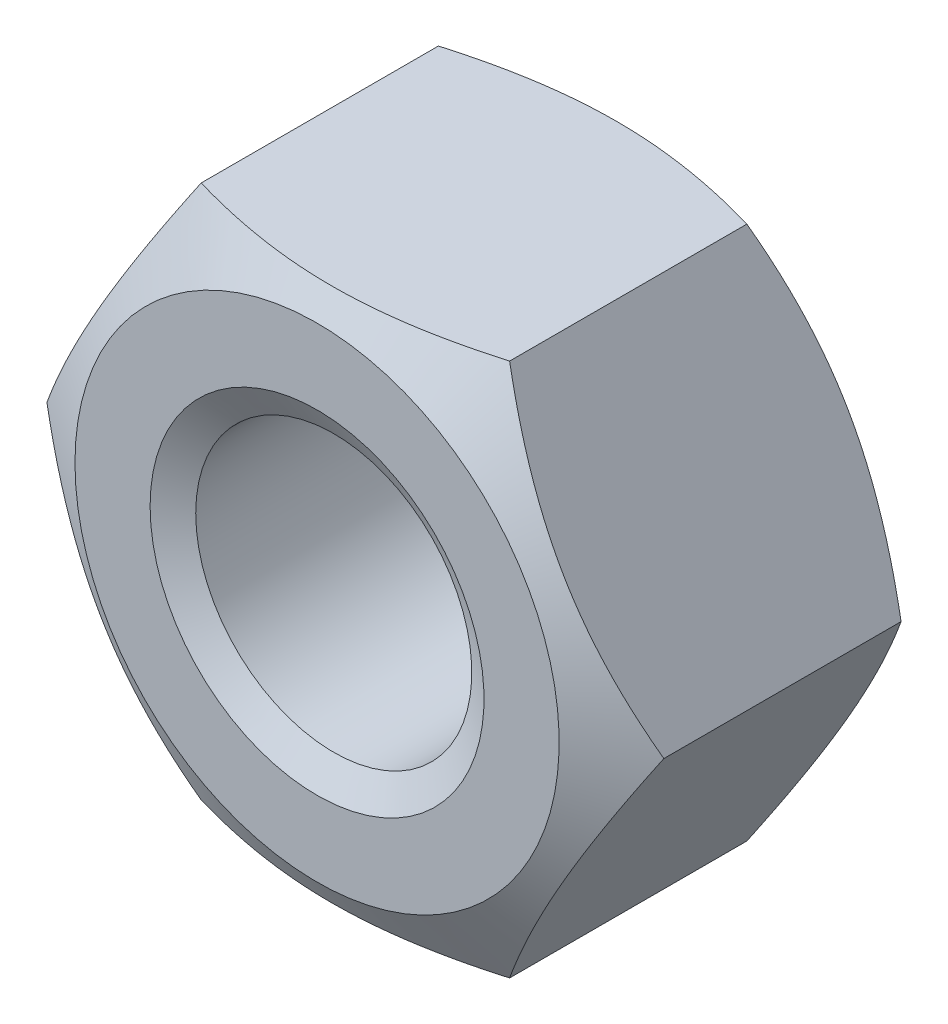
ISO-10303-21;
HEADER;
FILE_DESCRIPTION(('STEP AP214'),'2;1');
FILE_NAME('part.step','',(''),(''),'','','');
FILE_SCHEMA(('AUTOMOTIVE_DESIGN { 1 0 10303 214 1 1 1 1 }'));
ENDSEC;
DATA;
#1=APPLICATION_CONTEXT('core data for automotive mechanical design processes');
#2=APPLICATION_PROTOCOL_DEFINITION('international standard','automotive_design',2000,#1);
#3=PRODUCT_CONTEXT('',#1,'mechanical');
#4=PRODUCT('Part','Part','',(#3));
#5=PRODUCT_RELATED_PRODUCT_CATEGORY('part','',(#4));
#6=PRODUCT_DEFINITION_FORMATION('','',#4);
#7=PRODUCT_DEFINITION_CONTEXT('part definition',#1,'design');
#8=PRODUCT_DEFINITION('design','',#6,#7);
#9=PRODUCT_DEFINITION_SHAPE('','',#8);
#10=(LENGTH_UNIT() NAMED_UNIT(*) SI_UNIT(.MILLI.,.METRE.));
#11=(NAMED_UNIT(*) PLANE_ANGLE_UNIT() SI_UNIT($,.RADIAN.));
#12=(NAMED_UNIT(*) SI_UNIT($,.STERADIAN.) SOLID_ANGLE_UNIT());
#13=UNCERTAINTY_MEASURE_WITH_UNIT(LENGTH_MEASURE(1.E-05),#10,'distance_accuracy_value','');
#14=(GEOMETRIC_REPRESENTATION_CONTEXT(3) GLOBAL_UNCERTAINTY_ASSIGNED_CONTEXT((#13)) GLOBAL_UNIT_ASSIGNED_CONTEXT((#10,
#11,#12)) REPRESENTATION_CONTEXT('',''));
#15=CARTESIAN_POINT('',(0.,0.,0.));
#16=DIRECTION('',(0.,0.,1.));
#17=DIRECTION('',(1.,0.,0.));
#18=AXIS2_PLACEMENT_3D('',#15,#16,#17);
#19=CARTESIAN_POINT('',(2.30940107675851,-4.,-4.7));
#20=DIRECTION('',(0.866025403784439,-0.5,0.));
#21=DIRECTION('',(0.5,0.866025403784439,0.));
#22=AXIS2_PLACEMENT_3D('',#19,#20,#21);
#23=PLANE('',#22);
#24=CARTESIAN_POINT('',(2.30928560670467,-4.0002,-0.57383861002087));
#25=CARTESIAN_POINT('',(2.41077174646171,-3.82442084967677,-0.515224224594386));
#26=CARTESIAN_POINT('',(2.513133908835,-3.64712438367362,-0.461916672408367));
#27=CARTESIAN_POINT('',(2.71963072479812,-3.28946140682429,-0.368868021692509));
#28=CARTESIAN_POINT('',(2.82376904741905,-3.10908854102985,-0.32915983997581));
#29=CARTESIAN_POINT('',(3.03075510011796,-2.75057818129721,-0.267348566226386));
#30=CARTESIAN_POINT('',(3.13357098372492,-2.57249584706486,-0.244834082468996));
#31=CARTESIAN_POINT('',(3.33968651028529,-2.21549328283349,-0.21795697409269));
#32=CARTESIAN_POINT('',(3.44298540411434,-2.0365743503559,-0.213572092373052));
#33=CARTESIAN_POINT('',(3.63600352522933,-1.70225715780327,-0.222696423886078));
#34=CARTESIAN_POINT('',(3.72575165335065,-1.54680884001293,-0.233965304934102));
#35=CARTESIAN_POINT('',(3.90466320392055,-1.23692494436494,-0.2696803417443));
#36=CARTESIAN_POINT('',(3.99382600759479,-1.08249043825587,-0.29413869665764));
#37=CARTESIAN_POINT('',(4.17310641015197,-0.771967672225422,-0.355282415865396));
#38=CARTESIAN_POINT('',(4.26320131938131,-0.615918711936898,-0.39222695460097));
#39=CARTESIAN_POINT('',(4.44204742827551,-0.306148164596161,-0.476076423494133));
#40=CARTESIAN_POINT('',(4.53080091904967,-0.152422609226222,-0.522961653158845));
#41=CARTESIAN_POINT('',(4.61891762357085,0.000199999999998455,-0.573838610020871));
#42=B_SPLINE_CURVE_WITH_KNOTS('',3,(#24,#25,#26,#27,#28,#29,#30,#31,#32,#33,#34,#35,#36,#37,#38,
#39,#40,#41),.UNSPECIFIED.,.F.,.F.,(4,2,2,2,2,2,2,2,4),(0.,0.634047835695965,1.26961969224543,
1.88946157213122,2.50854226669297,3.04757825393385,3.58711366126903,4.13861653143763,
4.68903648037743),.UNSPECIFIED.);
#43=CARTESIAN_POINT('',(2.30940107675851,-4.,-0.573771940854266));
#44=VERTEX_POINT('',#43);
#45=CARTESIAN_POINT('',(4.61880215351701,0.,-0.573771940854266));
#46=VERTEX_POINT('',#45);
#47=EDGE_CURVE('E50',#44,#46,#42,.T.);
#48=ORIENTED_EDGE('',*,*,#47,.F.);
#49=DIRECTION('',(0.,0.,1.));
#50=VECTOR('',#49,1.);
#51=CARTESIAN_POINT('',(2.30940107675851,-4.,-4.7));
#52=LINE('',#51,#50);
#53=CARTESIAN_POINT('',(2.30940107675851,-4.,-4.12622805914573));
#54=VERTEX_POINT('',#53);
#55=EDGE_CURVE('E114',#54,#44,#52,.T.);
#56=ORIENTED_EDGE('',*,*,#55,.F.);
#57=CARTESIAN_POINT('',(4.61891762357085,0.000199999999998174,-4.12616138997913));
#58=CARTESIAN_POINT('',(4.51743148381381,-0.17557915032323,-4.18477577540561));
#59=CARTESIAN_POINT('',(4.41506932144052,-0.352875616326382,-4.23808332759163));
#60=CARTESIAN_POINT('',(4.2085725054774,-0.710538593175708,-4.33113197830749));
#61=CARTESIAN_POINT('',(4.10443418285647,-0.890911458970153,-4.37084016002419));
#62=CARTESIAN_POINT('',(3.89744813015756,-1.24942181870279,-4.43265143377361));
#63=CARTESIAN_POINT('',(3.7946322465506,-1.42750415293514,-4.455165917531));
#64=CARTESIAN_POINT('',(3.58851671999023,-1.78450671716651,-4.48204302590731));
#65=CARTESIAN_POINT('',(3.48521782616117,-1.9634256496441,-4.48642790762695));
#66=CARTESIAN_POINT('',(3.29219970504619,-2.29774284219673,-4.47730357611392));
#67=CARTESIAN_POINT('',(3.20245157692487,-2.45319115998707,-4.4660346950659));
#68=CARTESIAN_POINT('',(3.02354002635497,-2.76307505563506,-4.4303196582557));
#69=CARTESIAN_POINT('',(2.93437722268073,-2.91750956174413,-4.40586130334236));
#70=CARTESIAN_POINT('',(2.75509682012354,-3.22803232777458,-4.3447175841346));
#71=CARTESIAN_POINT('',(2.6650019108942,-3.3840812880631,-4.30777304539903));
#72=CARTESIAN_POINT('',(2.48615580200001,-3.69385183540384,-4.22392357650587));
#73=CARTESIAN_POINT('',(2.39740231122585,-3.84757739077378,-4.17703834684116));
#74=CARTESIAN_POINT('',(2.30928560670467,-4.0002,-4.12616138997913));
#75=B_SPLINE_CURVE_WITH_KNOTS('',3,(#57,#58,#59,#60,#61,#62,#63,#64,#65,#66,#67,#68,#69,#70,#71,
#72,#73,#74),.UNSPECIFIED.,.F.,.F.,(4,2,2,2,2,2,2,2,4),(0.,0.634047835695965,1.26961969224543,
1.88946157213122,2.50854226669297,3.04757825393386,3.58711366126903,4.13861653143763,
4.68903648037743),.UNSPECIFIED.);
#76=CARTESIAN_POINT('',(4.61880215351701,0.,-4.12622805914573));
#77=VERTEX_POINT('',#76);
#78=EDGE_CURVE('E125',#77,#54,#75,.T.);
#79=ORIENTED_EDGE('',*,*,#78,.F.);
#80=DIRECTION('',(0.,0.,1.));
#81=VECTOR('',#80,1.);
#82=CARTESIAN_POINT('',(4.61880215351701,0.,-4.7));
#83=LINE('',#82,#81);
#84=EDGE_CURVE('E122',#77,#46,#83,.T.);
#85=ORIENTED_EDGE('',*,*,#84,.T.);
#86=EDGE_LOOP('',(#48,#56,#79,#85));
#87=FACE_BOUND('',#86,.T.);
#88=ADVANCED_FACE('F35',(#87),#23,.T.);
#89=CARTESIAN_POINT('',(-2.3094010767585,-4.,-4.7));
#90=DIRECTION('',(0.,-1.,0.));
#91=DIRECTION('',(0.,0.,-1.));
#92=AXIS2_PLACEMENT_3D('',#89,#90,#91);
#93=PLANE('',#92);
#94=CARTESIAN_POINT('',(-6.09489331698854,-4.,-2.11613226172565));
#95=CARTESIAN_POINT('',(-5.91950199157586,-4.,-2.03149845459354));
#96=CARTESIAN_POINT('',(-5.74369257215838,-4.,-1.94771521780251));
#97=CARTESIAN_POINT('',(-5.39101133395398,-4.,-1.78233664211192));
#98=CARTESIAN_POINT('',(-5.21413933441671,-4.,-1.70074168913585));
#99=CARTESIAN_POINT('',(-4.85813636500876,-4.,-1.5397900151928));
#100=CARTESIAN_POINT('',(-4.67899824046454,-4.,-1.46044906153751));
#101=CARTESIAN_POINT('',(-4.31923849988323,-4.,-1.3052185148072));
#102=CARTESIAN_POINT('',(-4.13861696282555,-4.,-1.22932873937402));
#103=CARTESIAN_POINT('',(-3.7735011480398,-4.,-1.08107583924949));
#104=CARTESIAN_POINT('',(-3.58898622005784,-4.,-1.00876328992994));
#105=CARTESIAN_POINT('',(-3.21776937752919,-4.,-0.869876931081911));
#106=CARTESIAN_POINT('',(-3.03106722115793,-4.,-0.803303763044689));
#107=CARTESIAN_POINT('',(-2.65557248328835,-4.,-0.677706911420482));
#108=CARTESIAN_POINT('',(-2.46678541613765,-4.,-0.618666911849641));
#109=CARTESIAN_POINT('',(-2.08652902254126,-4.,-0.510073166124483));
#110=CARTESIAN_POINT('',(-1.8950605731911,-4.,-0.460516392299829));
#111=CARTESIAN_POINT('',(-1.50929874076661,-4.,-0.373311085934221));
#112=CARTESIAN_POINT('',(-1.31500426032992,-4.,-0.335667315781999));
#113=CARTESIAN_POINT('',(-0.924106700196855,-4.,-0.274847986643173));
#114=CARTESIAN_POINT('',(-0.727503612751561,-4.,-0.25167247623386));
#115=CARTESIAN_POINT('',(-0.334240681056907,-4.,-0.221840557573744));
#116=CARTESIAN_POINT('',(-0.137588730976595,-4.,-0.215082720352833));
#117=CARTESIAN_POINT('',(0.255527926525665,-4.,-0.218431875319073));
#118=CARTESIAN_POINT('',(0.451992668517273,-4.,-0.228534642276789));
#119=CARTESIAN_POINT('',(0.788354694254841,-4.,-0.259560117675914));
#120=CARTESIAN_POINT('',(0.928625472737157,-4.,-0.27664196987692));
#121=CARTESIAN_POINT('',(1.20806274563188,-4.,-0.318274124275839));
#122=CARTESIAN_POINT('',(1.34722906903656,-4.,-0.34282556073515));
#123=CARTESIAN_POINT('',(1.7632975044686,-4.,-0.426460434693975));
#124=CARTESIAN_POINT('',(2.03822284110857,-4.,-0.49546767495266));
#125=CARTESIAN_POINT('',(2.44940900931328,-4.,-0.61419997952369));
#126=CARTESIAN_POINT('',(2.58782303777094,-4.,-0.656885050843219));
#127=CARTESIAN_POINT('',(2.86331367399499,-4.,-0.746448608551732));
#128=CARTESIAN_POINT('',(3.00039016121333,-4.,-0.793327469111018));
#129=CARTESIAN_POINT('',(3.27252112795078,-4.,-0.89027873080736));
#130=CARTESIAN_POINT('',(3.4075826648663,-4.,-0.940331521678568));
#131=CARTESIAN_POINT('',(3.67656082616028,-4.,-1.04329523164377));
#132=CARTESIAN_POINT('',(3.81047782797029,-4.,-1.09620516281665));
#133=CARTESIAN_POINT('',(3.94391362275132,-4.,-1.15027525964541));
#134=B_SPLINE_CURVE_WITH_KNOTS('',3,(#94,#95,#96,#97,#98,#99,#100,#101,#102,#103,#104,#105,#106,
#107,#108,#109,#110,#111,#112,#113,#114,#115,#116,#117,#118,#119,#120,#121,#122,#123,#124,#125,
#126,#127,#128,#129,#130,#131,#132,#133),.UNSPECIFIED.,.F.,.F.,(4,2,2,2,2,2,2,2,2,2,2,2,2,2,2,2,
2,2,2,4),(0.,0.584238260269169,1.16857888752959,1.7563161578612,2.34402233634429,
2.93848518113533,3.53301438319361,4.12623321773499,4.71926234060197,5.31252823650208,
5.90579612428622,6.4953893548323,7.08483485682726,7.5085487103983,7.93232693734391,
8.78152355201763,9.21602908260414,9.65057341855461,10.0826543795838,10.5145868837227),.UNSPECIFIED.);
#135=CARTESIAN_POINT('',(-2.3094010767585,-4.,-0.573771940854266));
#136=VERTEX_POINT('',#135);
#137=EDGE_CURVE('E107',#136,#44,#134,.T.);
#138=ORIENTED_EDGE('',*,*,#137,.F.);
#139=DIRECTION('',(0.,0.,1.));
#140=VECTOR('',#139,1.);
#141=CARTESIAN_POINT('',(-2.3094010767585,-4.,-4.7));
#142=LINE('',#141,#140);
#143=CARTESIAN_POINT('',(-2.3094010767585,-4.,-4.12622805914573));
#144=VERTEX_POINT('',#143);
#145=EDGE_CURVE('E106',#144,#136,#142,.T.);
#146=ORIENTED_EDGE('',*,*,#145,.F.);
#147=CARTESIAN_POINT('',(-6.09489331698854,-4.,-2.58386773827435));
#148=CARTESIAN_POINT('',(-5.91950199157586,-4.,-2.66850154540646));
#149=CARTESIAN_POINT('',(-5.74369257215838,-4.,-2.75228478219749));
#150=CARTESIAN_POINT('',(-5.39101133395398,-4.,-2.91766335788808));
#151=CARTESIAN_POINT('',(-5.2141393344167,-4.,-2.99925831086415));
#152=CARTESIAN_POINT('',(-4.85813636500875,-4.,-3.1602099848072));
#153=CARTESIAN_POINT('',(-4.67899824046453,-4.,-3.23955093846249));
#154=CARTESIAN_POINT('',(-4.31923849988323,-4.,-3.3947814851928));
#155=CARTESIAN_POINT('',(-4.13861696282554,-4.,-3.47067126062598));
#156=CARTESIAN_POINT('',(-3.7735011480398,-4.,-3.61892416075051));
#157=CARTESIAN_POINT('',(-3.58898622005784,-4.,-3.69123671007006));
#158=CARTESIAN_POINT('',(-3.21776937752918,-4.,-3.83012306891809));
#159=CARTESIAN_POINT('',(-3.03106722115793,-4.,-3.89669623695531));
#160=CARTESIAN_POINT('',(-2.65557248328834,-4.,-4.02229308857952));
#161=CARTESIAN_POINT('',(-2.46678541613765,-4.,-4.08133308815036));
#162=CARTESIAN_POINT('',(-2.08652902254125,-4.,-4.18992683387552));
#163=CARTESIAN_POINT('',(-1.8950605731911,-4.,-4.23948360770017));
#164=CARTESIAN_POINT('',(-1.50929874076661,-4.,-4.32668891406578));
#165=CARTESIAN_POINT('',(-1.31500426032993,-4.,-4.364332684218));
#166=CARTESIAN_POINT('',(-0.924106700196855,-4.,-4.42515201335683));
#167=CARTESIAN_POINT('',(-0.727503612751561,-4.,-4.44832752376614));
#168=CARTESIAN_POINT('',(-0.334240681056908,-4.,-4.47815944242626));
#169=CARTESIAN_POINT('',(-0.137588730976595,-4.,-4.48491727964717));
#170=CARTESIAN_POINT('',(0.255527926525665,-4.,-4.48156812468093));
#171=CARTESIAN_POINT('',(0.451992668517273,-4.,-4.47146535772321));
#172=CARTESIAN_POINT('',(0.788354694254841,-4.,-4.44043988232409));
#173=CARTESIAN_POINT('',(0.928625472737157,-4.,-4.42335803012308));
#174=CARTESIAN_POINT('',(1.20806274563188,-4.,-4.38172587572416));
#175=CARTESIAN_POINT('',(1.34722906903656,-4.,-4.35717443926485));
#176=CARTESIAN_POINT('',(1.7632975044686,-4.,-4.27353956530602));
#177=CARTESIAN_POINT('',(2.03822284110857,-4.,-4.20453232504734));
#178=CARTESIAN_POINT('',(2.44940900931328,-4.,-4.08580002047631));
#179=CARTESIAN_POINT('',(2.58782303777094,-4.,-4.04311494915678));
#180=CARTESIAN_POINT('',(2.86331367399499,-4.,-3.95355139144827));
#181=CARTESIAN_POINT('',(3.00039016121333,-4.,-3.90667253088898));
#182=CARTESIAN_POINT('',(3.27252112795078,-4.,-3.80972126919264));
#183=CARTESIAN_POINT('',(3.4075826648663,-4.,-3.75966847832143));
#184=CARTESIAN_POINT('',(3.67656082616028,-4.,-3.65670476835623));
#185=CARTESIAN_POINT('',(3.81047782797029,-4.,-3.60379483718335));
#186=CARTESIAN_POINT('',(3.94391362275132,-4.,-3.54972474035459));
#187=B_SPLINE_CURVE_WITH_KNOTS('',3,(#147,#148,#149,#150,#151,#152,#153,#154,#155,#156,#157,
#158,#159,#160,#161,#162,#163,#164,#165,#166,#167,#168,#169,#170,#171,#172,#173,#174,#175,#176,
#177,#178,#179,#180,#181,#182,#183,#184,#185,#186),.UNSPECIFIED.,.F.,.F.,(4,2,2,2,2,2,2,2,2,2,2,
2,2,2,2,2,2,2,2,4),(0.,0.58423826026917,1.1685788875296,1.7563161578612,2.34402233634429,
2.93848518113534,3.53301438319361,4.12623321773499,4.71926234060197,5.31252823650208,
5.90579612428622,6.4953893548323,7.08483485682726,7.5085487103983,7.93232693734391,
8.78152355201763,9.21602908260414,9.65057341855461,10.0826543795838,10.5145868837227),.UNSPECIFIED.);
#188=EDGE_CURVE('E196',#54,#144,#187,.F.);
#189=ORIENTED_EDGE('',*,*,#188,.F.);
#190=ORIENTED_EDGE('',*,*,#55,.T.);
#191=EDGE_LOOP('',(#138,#146,#189,#190));
#192=FACE_BOUND('',#191,.T.);
#193=ADVANCED_FACE('F204',(#192),#93,.T.);
#194=CARTESIAN_POINT('',(-4.61880215351701,0.,-4.7));
#195=DIRECTION('',(-0.866025403784439,-0.5,0.));
#196=DIRECTION('',(0.5,-0.866025403784439,0.));
#197=AXIS2_PLACEMENT_3D('',#194,#195,#196);
#198=PLANE('',#197);
#199=CARTESIAN_POINT('',(-4.61891762357085,0.000200000000000886,-0.57383861002087));
#200=CARTESIAN_POINT('',(-4.51743148381381,-0.175579150323227,-0.515224224594387));
#201=CARTESIAN_POINT('',(-4.41506932144052,-0.35287561632638,-0.461916672408367));
#202=CARTESIAN_POINT('',(-4.2085725054774,-0.710538593175705,-0.368868021692509));
#203=CARTESIAN_POINT('',(-4.10443418285647,-0.890911458970149,-0.329159839975809));
#204=CARTESIAN_POINT('',(-3.89744813015756,-1.24942181870279,-0.267348566226385));
#205=CARTESIAN_POINT('',(-3.79463224655059,-1.42750415293514,-0.244834082468995));
#206=CARTESIAN_POINT('',(-3.58851671999023,-1.78450671716651,-0.217956974092688));
#207=CARTESIAN_POINT('',(-3.48521782616117,-1.9634256496441,-0.21357209237305));
#208=CARTESIAN_POINT('',(-3.29219970504619,-2.29774284219673,-0.222696423886076));
#209=CARTESIAN_POINT('',(-3.20245157692486,-2.45319115998706,-0.2339653049341));
#210=CARTESIAN_POINT('',(-3.02354002635497,-2.76307505563505,-0.269680341744298));
#211=CARTESIAN_POINT('',(-2.93437722268073,-2.91750956174413,-0.294138696657638));
#212=CARTESIAN_POINT('',(-2.75509682012354,-3.22803232777458,-0.355282415865393));
#213=CARTESIAN_POINT('',(-2.6650019108942,-3.3840812880631,-0.392226954600967));
#214=CARTESIAN_POINT('',(-2.48615580200001,-3.69385183540384,-0.476076423494129));
#215=CARTESIAN_POINT('',(-2.39740231122585,-3.84757739077378,-0.522961653158842));
#216=CARTESIAN_POINT('',(-2.30928560670467,-4.0002,-0.573838610020868));
#217=B_SPLINE_CURVE_WITH_KNOTS('',3,(#199,#200,#201,#202,#203,#204,#205,#206,#207,#208,#209,
#210,#211,#212,#213,#214,#215,#216),.UNSPECIFIED.,.F.,.F.,(4,2,2,2,2,2,2,2,4),(0.,
0.634047835695965,1.26961969224543,1.88946157213122,2.50854226669297,3.04757825393385,
3.58711366126903,4.13861653143764,4.68903648037743),.UNSPECIFIED.);
#218=CARTESIAN_POINT('',(-4.61880215351701,0.,-0.573771940854266));
#219=VERTEX_POINT('',#218);
#220=EDGE_CURVE('E90',#219,#136,#217,.T.);
#221=ORIENTED_EDGE('',*,*,#220,.F.);
#222=DIRECTION('',(0.,0.,1.));
#223=VECTOR('',#222,1.);
#224=CARTESIAN_POINT('',(-4.61880215351701,0.,-4.7));
#225=LINE('',#224,#223);
#226=CARTESIAN_POINT('',(-4.61880215351701,0.,-4.12622805914573));
#227=VERTEX_POINT('',#226);
#228=EDGE_CURVE('E104',#227,#219,#225,.T.);
#229=ORIENTED_EDGE('',*,*,#228,.F.);
#230=CARTESIAN_POINT('',(-2.30928560670467,-4.0002,-4.12616138997913));
#231=CARTESIAN_POINT('',(-2.4107717464617,-3.82442084967677,-4.18477577540562));
#232=CARTESIAN_POINT('',(-2.51313390883499,-3.64712438367362,-4.23808332759164));
#233=CARTESIAN_POINT('',(-2.71963072479811,-3.28946140682429,-4.33113197830749));
#234=CARTESIAN_POINT('',(-2.82376904741904,-3.10908854102985,-4.37084016002419));
#235=CARTESIAN_POINT('',(-3.03075510011795,-2.75057818129721,-4.43265143377362));
#236=CARTESIAN_POINT('',(-3.13357098372492,-2.57249584706486,-4.45516591753101));
#237=CARTESIAN_POINT('',(-3.33968651028528,-2.21549328283349,-4.48204302590731));
#238=CARTESIAN_POINT('',(-3.44298540411434,-2.0365743503559,-4.48642790762695));
#239=CARTESIAN_POINT('',(-3.63600352522932,-1.70225715780327,-4.47730357611392));
#240=CARTESIAN_POINT('',(-3.72575165335065,-1.54680884001293,-4.4660346950659));
#241=CARTESIAN_POINT('',(-3.90466320392054,-1.23692494436494,-4.4303196582557));
#242=CARTESIAN_POINT('',(-3.99382600759478,-1.08249043825587,-4.40586130334236));
#243=CARTESIAN_POINT('',(-4.17310641015197,-0.771967672225422,-4.34471758413461));
#244=CARTESIAN_POINT('',(-4.26320131938131,-0.615918711936897,-4.30777304539903));
#245=CARTESIAN_POINT('',(-4.4420474282755,-0.30614816459616,-4.22392357650587));
#246=CARTESIAN_POINT('',(-4.53080091904966,-0.15242260922622,-4.17703834684116));
#247=CARTESIAN_POINT('',(-4.61891762357085,0.000200000000000964,-4.12616138997913));
#248=B_SPLINE_CURVE_WITH_KNOTS('',3,(#230,#231,#232,#233,#234,#235,#236,#237,#238,#239,#240,
#241,#242,#243,#244,#245,#246,#247),.UNSPECIFIED.,.F.,.F.,(4,2,2,2,2,2,2,2,4),(0.,
0.634047835695965,1.26961969224543,1.88946157213122,2.50854226669297,3.04757825393385,
3.58711366126903,4.13861653143764,4.68903648037743),.UNSPECIFIED.);
#249=EDGE_CURVE('E190',#144,#227,#248,.T.);
#250=ORIENTED_EDGE('',*,*,#249,.F.);
#251=ORIENTED_EDGE('',*,*,#145,.T.);
#252=EDGE_LOOP('',(#221,#229,#250,#251));
#253=FACE_BOUND('',#252,.T.);
#254=ADVANCED_FACE('F102',(#253),#198,.T.);
#255=CARTESIAN_POINT('',(-2.3094010767585,4.,-4.7));
#256=DIRECTION('',(-0.866025403784439,0.5,0.));
#257=DIRECTION('',(-0.5,-0.866025403784439,0.));
#258=AXIS2_PLACEMENT_3D('',#255,#256,#257);
#259=PLANE('',#258);
#260=CARTESIAN_POINT('',(-2.30928560670467,4.0002,-0.57383861002087));
#261=CARTESIAN_POINT('',(-2.4107717464617,3.82442084967677,-0.515224224594387));
#262=CARTESIAN_POINT('',(-2.51313390883499,3.64712438367362,-0.461916672408367));
#263=CARTESIAN_POINT('',(-2.71963072479812,3.2894614068243,-0.368868021692509));
#264=CARTESIAN_POINT('',(-2.82376904741904,3.10908854102985,-0.32915983997581));
#265=CARTESIAN_POINT('',(-3.03075510011795,2.75057818129721,-0.267348566226385));
#266=CARTESIAN_POINT('',(-3.13357098372492,2.57249584706486,-0.244834082468996));
#267=CARTESIAN_POINT('',(-3.33968651028528,2.21549328283349,-0.217956974092689));
#268=CARTESIAN_POINT('',(-3.44298540411434,2.0365743503559,-0.21357209237305));
#269=CARTESIAN_POINT('',(-3.63600352522932,1.70225715780327,-0.222696423886077));
#270=CARTESIAN_POINT('',(-3.72575165335065,1.54680884001294,-0.233965304934101));
#271=CARTESIAN_POINT('',(-3.90466320392054,1.23692494436495,-0.269680341744299));
#272=CARTESIAN_POINT('',(-3.99382600759478,1.08249043825587,-0.294138696657639));
#273=CARTESIAN_POINT('',(-4.17310641015197,0.771967672225424,-0.355282415865395));
#274=CARTESIAN_POINT('',(-4.26320131938131,0.615918711936899,-0.392226954600968));
#275=CARTESIAN_POINT('',(-4.4420474282755,0.306148164596162,-0.476076423494131));
#276=CARTESIAN_POINT('',(-4.53080091904966,0.152422609226222,-0.522961653158843));
#277=CARTESIAN_POINT('',(-4.61891762357085,-0.00019999999999904,-0.57383861002087));
#278=B_SPLINE_CURVE_WITH_KNOTS('',3,(#260,#261,#262,#263,#264,#265,#266,#267,#268,#269,#270,
#271,#272,#273,#274,#275,#276,#277),.UNSPECIFIED.,.F.,.F.,(4,2,2,2,2,2,2,2,4),(0.,
0.634047835695965,1.26961969224543,1.88946157213122,2.50854226669297,3.04757825393385,
3.58711366126903,4.13861653143764,4.68903648037743),.UNSPECIFIED.);
#279=CARTESIAN_POINT('',(-2.30940107675851,4.,-0.573771940854266));
#280=VERTEX_POINT('',#279);
#281=EDGE_CURVE('E86',#280,#219,#278,.T.);
#282=ORIENTED_EDGE('',*,*,#281,.F.);
#283=DIRECTION('',(0.,0.,1.));
#284=VECTOR('',#283,1.);
#285=CARTESIAN_POINT('',(-2.3094010767585,4.,-4.7));
#286=LINE('',#285,#284);
#287=CARTESIAN_POINT('',(-2.3094010767585,4.,-4.12622805914573));
#288=VERTEX_POINT('',#287);
#289=EDGE_CURVE('E112',#288,#280,#286,.T.);
#290=ORIENTED_EDGE('',*,*,#289,.F.);
#291=CARTESIAN_POINT('',(-4.61891762357085,-0.000199999999999153,-4.12616138997913));
#292=CARTESIAN_POINT('',(-4.51743148381381,0.175579150323229,-4.18477577540561));
#293=CARTESIAN_POINT('',(-4.41506932144052,0.352875616326382,-4.23808332759163));
#294=CARTESIAN_POINT('',(-4.2085725054774,0.710538593175707,-4.33113197830749));
#295=CARTESIAN_POINT('',(-4.10443418285647,0.890911458970151,-4.37084016002419));
#296=CARTESIAN_POINT('',(-3.89744813015756,1.24942181870279,-4.43265143377362));
#297=CARTESIAN_POINT('',(-3.7946322465506,1.42750415293514,-4.45516591753101));
#298=CARTESIAN_POINT('',(-3.58851671999023,1.78450671716651,-4.48204302590731));
#299=CARTESIAN_POINT('',(-3.48521782616117,1.9634256496441,-4.48642790762695));
#300=CARTESIAN_POINT('',(-3.29219970504619,2.29774284219673,-4.47730357611392));
#301=CARTESIAN_POINT('',(-3.20245157692487,2.45319115998706,-4.4660346950659));
#302=CARTESIAN_POINT('',(-3.02354002635497,2.76307505563505,-4.4303196582557));
#303=CARTESIAN_POINT('',(-2.93437722268073,2.91750956174413,-4.40586130334236));
#304=CARTESIAN_POINT('',(-2.75509682012354,3.22803232777458,-4.34471758413461));
#305=CARTESIAN_POINT('',(-2.6650019108942,3.3840812880631,-4.30777304539903));
#306=CARTESIAN_POINT('',(-2.48615580200001,3.69385183540384,-4.22392357650587));
#307=CARTESIAN_POINT('',(-2.39740231122585,3.84757739077378,-4.17703834684116));
#308=CARTESIAN_POINT('',(-2.30928560670467,4.0002,-4.12616138997913));
#309=B_SPLINE_CURVE_WITH_KNOTS('',3,(#291,#292,#293,#294,#295,#296,#297,#298,#299,#300,#301,
#302,#303,#304,#305,#306,#307,#308),.UNSPECIFIED.,.F.,.F.,(4,2,2,2,2,2,2,2,4),(0.,
0.634047835695965,1.26961969224543,1.88946157213122,2.50854226669297,3.04757825393385,
3.58711366126903,4.13861653143764,4.68903648037743),.UNSPECIFIED.);
#310=EDGE_CURVE('E111',#227,#288,#309,.T.);
#311=ORIENTED_EDGE('',*,*,#310,.F.);
#312=ORIENTED_EDGE('',*,*,#228,.T.);
#313=EDGE_LOOP('',(#282,#290,#311,#312));
#314=FACE_BOUND('',#313,.T.);
#315=ADVANCED_FACE('F110',(#314),#259,.T.);
#316=CARTESIAN_POINT('',(2.3094010767585,4.,-4.7));
#317=DIRECTION('',(0.,1.,0.));
#318=DIRECTION('',(0.,0.,1.));
#319=AXIS2_PLACEMENT_3D('',#316,#317,#318);
#320=PLANE('',#319);
#321=CARTESIAN_POINT('',(-6.09489331698854,4.,-2.11613226172566));
#322=CARTESIAN_POINT('',(-5.91950199157587,4.,-2.03149845459354));
#323=CARTESIAN_POINT('',(-5.74369257215839,4.,-1.94771521780252));
#324=CARTESIAN_POINT('',(-5.39101133395399,4.,-1.78233664211192));
#325=CARTESIAN_POINT('',(-5.21413933441671,4.,-1.70074168913585));
#326=CARTESIAN_POINT('',(-4.85813636500876,4.,-1.5397900151928));
#327=CARTESIAN_POINT('',(-4.67899824046454,4.,-1.46044906153752));
#328=CARTESIAN_POINT('',(-4.31923849988323,4.,-1.3052185148072));
#329=CARTESIAN_POINT('',(-4.13861696282555,4.,-1.22932873937402));
#330=CARTESIAN_POINT('',(-3.7735011480398,4.,-1.08107583924949));
#331=CARTESIAN_POINT('',(-3.58898622005784,4.,-1.00876328992994));
#332=CARTESIAN_POINT('',(-3.21776937752919,4.,-0.869876931081913));
#333=CARTESIAN_POINT('',(-3.03106722115793,4.,-0.803303763044691));
#334=CARTESIAN_POINT('',(-2.65557248328835,4.,-0.677706911420484));
#335=CARTESIAN_POINT('',(-2.46678541613765,4.,-0.618666911849642));
#336=CARTESIAN_POINT('',(-2.08652902254126,4.,-0.510073166124485));
#337=CARTESIAN_POINT('',(-1.8950605731911,4.,-0.460516392299831));
#338=CARTESIAN_POINT('',(-1.50929874076661,4.,-0.373311085934223));
#339=CARTESIAN_POINT('',(-1.31500426032992,4.,-0.335667315782002));
#340=CARTESIAN_POINT('',(-0.924106700196855,4.,-0.274847986643176));
#341=CARTESIAN_POINT('',(-0.727503612751561,4.,-0.251672476233863));
#342=CARTESIAN_POINT('',(-0.334240681056907,4.,-0.221840557573747));
#343=CARTESIAN_POINT('',(-0.137588730976594,4.,-0.215082720352835));
#344=CARTESIAN_POINT('',(0.255527926525667,4.,-0.218431875319075));
#345=CARTESIAN_POINT('',(0.451992668517275,4.,-0.228534642276791));
#346=CARTESIAN_POINT('',(0.788354694254844,4.,-0.259560117675917));
#347=CARTESIAN_POINT('',(0.92862547273716,4.,-0.276641969876923));
#348=CARTESIAN_POINT('',(1.20806274563188,4.,-0.318274124275842));
#349=CARTESIAN_POINT('',(1.34722906903656,4.,-0.342825560735153));
#350=CARTESIAN_POINT('',(1.76329750446861,4.,-0.426460434693979));
#351=CARTESIAN_POINT('',(2.03822284110857,4.,-0.495467674952664));
#352=CARTESIAN_POINT('',(2.44940900931328,4.,-0.614199979523694));
#353=CARTESIAN_POINT('',(2.58782303777094,4.,-0.656885050843223));
#354=CARTESIAN_POINT('',(2.86331367399499,4.,-0.746448608551736));
#355=CARTESIAN_POINT('',(3.00039016121333,4.,-0.793327469111022));
#356=CARTESIAN_POINT('',(3.27252112795079,4.,-0.890278730807364));
#357=CARTESIAN_POINT('',(3.4075826648663,4.,-0.940331521678572));
#358=CARTESIAN_POINT('',(3.67656082616029,4.,-1.04329523164378));
#359=CARTESIAN_POINT('',(3.8104778279703,4.,-1.09620516281666));
#360=CARTESIAN_POINT('',(3.94391362275133,4.,-1.15027525964541));
#361=B_SPLINE_CURVE_WITH_KNOTS('',3,(#321,#322,#323,#324,#325,#326,#327,#328,#329,#330,#331,
#332,#333,#334,#335,#336,#337,#338,#339,#340,#341,#342,#343,#344,#345,#346,#347,#348,#349,#350,
#351,#352,#353,#354,#355,#356,#357,#358,#359,#360),.UNSPECIFIED.,.F.,.F.,(4,2,2,2,2,2,2,2,2,2,2,
2,2,2,2,2,2,2,2,4),(0.,0.58423826026917,1.1685788875296,1.7563161578612,2.34402233634429,
2.93848518113534,3.53301438319362,4.12623321773499,4.71926234060198,5.31252823650209,
5.90579612428623,6.49538935483231,7.08483485682727,7.50854871039831,7.93232693734392,
8.78152355201764,9.21602908260415,9.65057341855463,10.0826543795838,10.5145868837227),.UNSPECIFIED.);
#362=CARTESIAN_POINT('',(2.3094010767585,4.,-0.573771940854266));
#363=VERTEX_POINT('',#362);
#364=EDGE_CURVE('E93',#363,#280,#361,.F.);
#365=ORIENTED_EDGE('',*,*,#364,.F.);
#366=DIRECTION('',(0.,0.,1.));
#367=VECTOR('',#366,1.);
#368=CARTESIAN_POINT('',(2.3094010767585,4.,-4.7));
#369=LINE('',#368,#367);
#370=CARTESIAN_POINT('',(2.3094010767585,4.,-4.12622805914573));
#371=VERTEX_POINT('',#370);
#372=EDGE_CURVE('E116',#371,#363,#369,.T.);
#373=ORIENTED_EDGE('',*,*,#372,.F.);
#374=CARTESIAN_POINT('',(-6.09489331698854,4.,-2.58386773827434));
#375=CARTESIAN_POINT('',(-5.91950199157587,4.,-2.66850154540646));
#376=CARTESIAN_POINT('',(-5.74369257215839,4.,-2.75228478219748));
#377=CARTESIAN_POINT('',(-5.39101133395399,4.,-2.91766335788808));
#378=CARTESIAN_POINT('',(-5.21413933441671,4.,-2.99925831086415));
#379=CARTESIAN_POINT('',(-4.85813636500876,4.,-3.1602099848072));
#380=CARTESIAN_POINT('',(-4.67899824046454,4.,-3.23955093846248));
#381=CARTESIAN_POINT('',(-4.31923849988323,4.,-3.3947814851928));
#382=CARTESIAN_POINT('',(-4.13861696282555,4.,-3.47067126062598));
#383=CARTESIAN_POINT('',(-3.7735011480398,4.,-3.61892416075051));
#384=CARTESIAN_POINT('',(-3.58898622005784,4.,-3.69123671007006));
#385=CARTESIAN_POINT('',(-3.21776937752919,4.,-3.83012306891809));
#386=CARTESIAN_POINT('',(-3.03106722115794,4.,-3.89669623695531));
#387=CARTESIAN_POINT('',(-2.65557248328835,4.,-4.02229308857952));
#388=CARTESIAN_POINT('',(-2.46678541613765,4.,-4.08133308815036));
#389=CARTESIAN_POINT('',(-2.08652902254126,4.,-4.18992683387552));
#390=CARTESIAN_POINT('',(-1.8950605731911,4.,-4.23948360770017));
#391=CARTESIAN_POINT('',(-1.50929874076661,4.,-4.32668891406578));
#392=CARTESIAN_POINT('',(-1.31500426032993,4.,-4.364332684218));
#393=CARTESIAN_POINT('',(-0.924106700196855,4.,-4.42515201335682));
#394=CARTESIAN_POINT('',(-0.727503612751561,4.,-4.44832752376614));
#395=CARTESIAN_POINT('',(-0.334240681056907,4.,-4.47815944242625));
#396=CARTESIAN_POINT('',(-0.137588730976594,4.,-4.48491727964717));
#397=CARTESIAN_POINT('',(0.255527926525667,4.,-4.48156812468093));
#398=CARTESIAN_POINT('',(0.451992668517275,4.,-4.47146535772321));
#399=CARTESIAN_POINT('',(0.788354694254844,4.,-4.44043988232408));
#400=CARTESIAN_POINT('',(0.92862547273716,4.,-4.42335803012308));
#401=CARTESIAN_POINT('',(1.20806274563188,4.,-4.38172587572416));
#402=CARTESIAN_POINT('',(1.34722906903656,4.,-4.35717443926485));
#403=CARTESIAN_POINT('',(1.76329750446861,4.,-4.27353956530602));
#404=CARTESIAN_POINT('',(2.03822284110857,4.,-4.20453232504734));
#405=CARTESIAN_POINT('',(2.44940900931329,4.,-4.08580002047631));
#406=CARTESIAN_POINT('',(2.58782303777094,4.,-4.04311494915678));
#407=CARTESIAN_POINT('',(2.86331367399499,4.,-3.95355139144826));
#408=CARTESIAN_POINT('',(3.00039016121333,4.,-3.90667253088898));
#409=CARTESIAN_POINT('',(3.27252112795079,4.,-3.80972126919264));
#410=CARTESIAN_POINT('',(3.4075826648663,4.,-3.75966847832143));
#411=CARTESIAN_POINT('',(3.67656082616029,4.,-3.65670476835623));
#412=CARTESIAN_POINT('',(3.8104778279703,4.,-3.60379483718334));
#413=CARTESIAN_POINT('',(3.94391362275133,4.,-3.54972474035459));
#414=B_SPLINE_CURVE_WITH_KNOTS('',3,(#374,#375,#376,#377,#378,#379,#380,#381,#382,#383,#384,
#385,#386,#387,#388,#389,#390,#391,#392,#393,#394,#395,#396,#397,#398,#399,#400,#401,#402,#403,
#404,#405,#406,#407,#408,#409,#410,#411,#412,#413),.UNSPECIFIED.,.F.,.F.,(4,2,2,2,2,2,2,2,2,2,2,
2,2,2,2,2,2,2,2,4),(0.,0.584238260269169,1.1685788875296,1.7563161578612,2.34402233634429,
2.93848518113534,3.53301438319362,4.12623321773499,4.71926234060198,5.31252823650209,
5.90579612428623,6.49538935483231,7.08483485682727,7.50854871039831,7.93232693734392,
8.78152355201764,9.21602908260415,9.65057341855463,10.0826543795838,10.5145868837227),.UNSPECIFIED.);
#415=EDGE_CURVE('E58',#288,#371,#414,.T.);
#416=ORIENTED_EDGE('',*,*,#415,.F.);
#417=ORIENTED_EDGE('',*,*,#289,.T.);
#418=EDGE_LOOP('',(#365,#373,#416,#417));
#419=FACE_BOUND('',#418,.T.);
#420=ADVANCED_FACE('F227',(#419),#320,.T.);
#421=CARTESIAN_POINT('',(4.61880215351701,0.,-4.7));
#422=DIRECTION('',(0.866025403784438,0.5,0.));
#423=DIRECTION('',(-0.5,0.866025403784438,0.));
#424=AXIS2_PLACEMENT_3D('',#421,#422,#423);
#425=PLANE('',#424);
#426=CARTESIAN_POINT('',(4.61891762357085,-0.000200000000001864,-0.573838610020871));
#427=CARTESIAN_POINT('',(4.51743148381381,0.175579150323226,-0.515224224594387));
#428=CARTESIAN_POINT('',(4.41506932144052,0.352875616326379,-0.461916672408368));
#429=CARTESIAN_POINT('',(4.2085725054774,0.710538593175704,-0.368868021692509));
#430=CARTESIAN_POINT('',(4.10443418285647,0.890911458970149,-0.32915983997581));
#431=CARTESIAN_POINT('',(3.89744813015756,1.24942181870279,-0.267348566226386));
#432=CARTESIAN_POINT('',(3.7946322465506,1.42750415293514,-0.244834082468995));
#433=CARTESIAN_POINT('',(3.58851671999023,1.78450671716651,-0.217956974092689));
#434=CARTESIAN_POINT('',(3.48521782616117,1.9634256496441,-0.21357209237305));
#435=CARTESIAN_POINT('',(3.29219970504619,2.29774284219673,-0.222696423886077));
#436=CARTESIAN_POINT('',(3.20245157692487,2.45319115998706,-0.2339653049341));
#437=CARTESIAN_POINT('',(3.02354002635497,2.76307505563505,-0.269680341744298));
#438=CARTESIAN_POINT('',(2.93437722268073,2.91750956174413,-0.294138696657638));
#439=CARTESIAN_POINT('',(2.75509682012354,3.22803232777458,-0.355282415865393));
#440=CARTESIAN_POINT('',(2.6650019108942,3.3840812880631,-0.392226954600967));
#441=CARTESIAN_POINT('',(2.48615580200001,3.69385183540384,-0.476076423494131));
#442=CARTESIAN_POINT('',(2.39740231122585,3.84757739077378,-0.522961653158843));
#443=CARTESIAN_POINT('',(2.30928560670466,4.0002,-0.573838610020869));
#444=B_SPLINE_CURVE_WITH_KNOTS('',3,(#426,#427,#428,#429,#430,#431,#432,#433,#434,#435,#436,
#437,#438,#439,#440,#441,#442,#443),.UNSPECIFIED.,.F.,.F.,(4,2,2,2,2,2,2,2,4),(0.,
0.634047835695966,1.26961969224543,1.88946157213122,2.50854226669297,3.04757825393386,
3.58711366126903,4.13861653143764,4.68903648037743),.UNSPECIFIED.);
#445=EDGE_CURVE('E249',#46,#363,#444,.T.);
#446=ORIENTED_EDGE('',*,*,#445,.F.);
#447=ORIENTED_EDGE('',*,*,#84,.F.);
#448=CARTESIAN_POINT('',(2.30928560670466,4.0002,-4.12616138997913));
#449=CARTESIAN_POINT('',(2.4107717464617,3.82442084967677,-4.18477577540561));
#450=CARTESIAN_POINT('',(2.51313390883499,3.64712438367362,-4.23808332759163));
#451=CARTESIAN_POINT('',(2.71963072479811,3.2894614068243,-4.33113197830749));
#452=CARTESIAN_POINT('',(2.82376904741904,3.10908854102985,-4.37084016002419));
#453=CARTESIAN_POINT('',(3.03075510011795,2.75057818129721,-4.43265143377362));
#454=CARTESIAN_POINT('',(3.13357098372492,2.57249584706486,-4.45516591753101));
#455=CARTESIAN_POINT('',(3.33968651028528,2.21549328283349,-4.48204302590731));
#456=CARTESIAN_POINT('',(3.44298540411434,2.0365743503559,-4.48642790762695));
#457=CARTESIAN_POINT('',(3.63600352522932,1.70225715780327,-4.47730357611392));
#458=CARTESIAN_POINT('',(3.72575165335064,1.54680884001294,-4.4660346950659));
#459=CARTESIAN_POINT('',(3.90466320392054,1.23692494436495,-4.4303196582557));
#460=CARTESIAN_POINT('',(3.99382600759478,1.08249043825587,-4.40586130334236));
#461=CARTESIAN_POINT('',(4.17310641015197,0.771967672225423,-4.34471758413461));
#462=CARTESIAN_POINT('',(4.26320131938131,0.615918711936898,-4.30777304539903));
#463=CARTESIAN_POINT('',(4.44204742827551,0.306148164596159,-4.22392357650587));
#464=CARTESIAN_POINT('',(4.53080091904966,0.152422609226219,-4.17703834684116));
#465=CARTESIAN_POINT('',(4.61891762357085,-0.000200000000001824,-4.12616138997913));
#466=B_SPLINE_CURVE_WITH_KNOTS('',3,(#448,#449,#450,#451,#452,#453,#454,#455,#456,#457,#458,
#459,#460,#461,#462,#463,#464,#465),.UNSPECIFIED.,.F.,.F.,(4,2,2,2,2,2,2,2,4),(0.,
0.634047835695966,1.26961969224543,1.88946157213122,2.50854226669297,3.04757825393386,
3.58711366126903,4.13861653143764,4.68903648037743),.UNSPECIFIED.);
#467=EDGE_CURVE('E152',#371,#77,#466,.T.);
#468=ORIENTED_EDGE('',*,*,#467,.F.);
#469=ORIENTED_EDGE('',*,*,#372,.T.);
#470=EDGE_LOOP('',(#446,#447,#468,#469));
#471=FACE_BOUND('',#470,.T.);
#472=ADVANCED_FACE('F146',(#471),#425,.T.);
#473=CARTESIAN_POINT('',(0.,-8.,-4.7));
#474=DIRECTION('',(0.,0.,-1.));
#475=DIRECTION('',(-1.,0.,0.));
#476=AXIS2_PLACEMENT_3D('',#473,#474,#475);
#477=PLANE('',#476);
#478=CARTESIAN_POINT('',(0.,0.,-4.7));
#479=DIRECTION('',(0.,0.,-1.));
#480=DIRECTION('',(-1.,0.,0.));
#481=AXIS2_PLACEMENT_3D('',#478,#479,#480);
#482=CIRCLE('',#481,2.31699266655911);
#483=CARTESIAN_POINT('',(-2.31699266655911,0.,-4.7));
#484=VERTEX_POINT('',#483);
#485=EDGE_CURVE('E126',#484,#484,#482,.F.);
#486=ORIENTED_EDGE('',*,*,#485,.T.);
#487=EDGE_LOOP('',(#486));
#488=FACE_BOUND('',#487,.T.);
#489=CARTESIAN_POINT('',(0.,0.,-4.7));
#490=DIRECTION('',(0.,0.,-1.));
#491=DIRECTION('',(-1.,0.,0.));
#492=AXIS2_PLACEMENT_3D('',#489,#490,#491);
#493=CIRCLE('',#492,3.625);
#494=CARTESIAN_POINT('',(-3.625,0.,-4.7));
#495=VERTEX_POINT('',#494);
#496=EDGE_CURVE('E150',#495,#495,#493,.T.);
#497=ORIENTED_EDGE('',*,*,#496,.T.);
#498=EDGE_LOOP('',(#497));
#499=FACE_BOUND('',#498,.T.);
#500=ADVANCED_FACE('F142',(#488,#499),#477,.T.);
#501=CARTESIAN_POINT('',(0.,-8.,0.));
#502=DIRECTION('',(0.,0.,-1.));
#503=DIRECTION('',(-1.,0.,0.));
#504=AXIS2_PLACEMENT_3D('',#501,#502,#503);
#505=PLANE('',#504);
#506=CARTESIAN_POINT('',(0.,0.,0.));
#507=DIRECTION('',(0.,0.,-1.));
#508=DIRECTION('',(-1.,0.,0.));
#509=AXIS2_PLACEMENT_3D('',#506,#507,#508);
#510=CIRCLE('',#509,2.5);
#511=CARTESIAN_POINT('',(-2.5,0.,0.));
#512=VERTEX_POINT('',#511);
#513=EDGE_CURVE('E11',#512,#512,#510,.T.);
#514=ORIENTED_EDGE('',*,*,#513,.T.);
#515=EDGE_LOOP('',(#514));
#516=FACE_BOUND('',#515,.T.);
#517=CARTESIAN_POINT('',(0.,0.,0.));
#518=DIRECTION('',(0.,0.,-1.));
#519=DIRECTION('',(-1.,0.,0.));
#520=AXIS2_PLACEMENT_3D('',#517,#518,#519);
#521=CIRCLE('',#520,3.625);
#522=CARTESIAN_POINT('',(-3.625,0.,0.));
#523=VERTEX_POINT('',#522);
#524=EDGE_CURVE('E250',#523,#523,#521,.T.);
#525=ORIENTED_EDGE('',*,*,#524,.F.);
#526=EDGE_LOOP('',(#525));
#527=FACE_BOUND('',#526,.T.);
#528=ADVANCED_FACE('F145',(#516,#527),#505,.F.);
#529=CARTESIAN_POINT('',(0.,0.,-4.7));
#530=DIRECTION('',(0.,0.,1.));
#531=DIRECTION('',(1.,0.,0.));
#532=AXIS2_PLACEMENT_3D('',#529,#530,#531);
#533=CYLINDRICAL_SURFACE('',#532,2.067);
#534=CARTESIAN_POINT('',(0.,0.,-4.267));
#535=DIRECTION('',(0.,0.,-1.));
#536=DIRECTION('',(-1.,0.,0.));
#537=AXIS2_PLACEMENT_3D('',#534,#535,#536);
#538=CIRCLE('',#537,2.067);
#539=CARTESIAN_POINT('',(-2.067,0.,-4.267));
#540=VERTEX_POINT('',#539);
#541=EDGE_CURVE('E43',#540,#540,#538,.T.);
#542=ORIENTED_EDGE('',*,*,#541,.T.);
#543=EDGE_LOOP('',(#542));
#544=FACE_BOUND('',#543,.T.);
#545=CARTESIAN_POINT('',(0.,0.,-0.24999266655911));
#546=DIRECTION('',(0.,0.,-1.));
#547=DIRECTION('',(-1.,0.,0.));
#548=AXIS2_PLACEMENT_3D('',#545,#546,#547);
#549=CIRCLE('',#548,2.067);
#550=CARTESIAN_POINT('',(-2.067,0.,-0.24999266655911));
#551=VERTEX_POINT('',#550);
#552=EDGE_CURVE('E129',#551,#551,#549,.F.);
#553=ORIENTED_EDGE('',*,*,#552,.T.);
#554=EDGE_LOOP('',(#553));
#555=FACE_BOUND('',#554,.T.);
#556=ADVANCED_FACE('F134',(#544,#555),#533,.F.);
#557=CARTESIAN_POINT('',(0.,0.,-4.12622805914573));
#558=DIRECTION('',(0.,0.,1.));
#559=DIRECTION('',(1.,0.,0.));
#560=AXIS2_PLACEMENT_3D('',#557,#558,#559);
#561=CONICAL_SURFACE('',#560,4.61880215351701,1.0471975511966);
#562=ORIENTED_EDGE('',*,*,#78,.T.);
#563=ORIENTED_EDGE('',*,*,#188,.T.);
#564=ORIENTED_EDGE('',*,*,#249,.T.);
#565=ORIENTED_EDGE('',*,*,#310,.T.);
#566=ORIENTED_EDGE('',*,*,#415,.T.);
#567=ORIENTED_EDGE('',*,*,#467,.T.);
#568=EDGE_LOOP('',(#562,#563,#564,#565,#566,#567));
#569=FACE_BOUND('',#568,.T.);
#570=ORIENTED_EDGE('',*,*,#496,.F.);
#571=EDGE_LOOP('',(#570));
#572=FACE_BOUND('',#571,.T.);
#573=ADVANCED_FACE('F174',(#569,#572),#561,.T.);
#574=CARTESIAN_POINT('',(0.,0.,0.));
#575=DIRECTION('',(0.,0.,-1.));
#576=DIRECTION('',(-1.,0.,0.));
#577=AXIS2_PLACEMENT_3D('',#574,#575,#576);
#578=CONICAL_SURFACE('',#577,3.625,1.0471975511966);
#579=ORIENTED_EDGE('',*,*,#47,.T.);
#580=ORIENTED_EDGE('',*,*,#445,.T.);
#581=ORIENTED_EDGE('',*,*,#364,.T.);
#582=ORIENTED_EDGE('',*,*,#281,.T.);
#583=ORIENTED_EDGE('',*,*,#220,.T.);
#584=ORIENTED_EDGE('',*,*,#137,.T.);
#585=EDGE_LOOP('',(#579,#580,#581,#582,#583,#584));
#586=FACE_BOUND('',#585,.T.);
#587=ORIENTED_EDGE('',*,*,#524,.T.);
#588=EDGE_LOOP('',(#587));
#589=FACE_BOUND('',#588,.T.);
#590=ADVANCED_FACE('F88',(#586,#589),#578,.T.);
#591=CARTESIAN_POINT('',(0.,0.,-4.7));
#592=DIRECTION('',(0.,0.,-1.));
#593=DIRECTION('',(-1.,0.,0.));
#594=AXIS2_PLACEMENT_3D('',#591,#592,#593);
#595=CONICAL_SURFACE('',#594,2.31699266655911,0.523598775598297);
#596=ORIENTED_EDGE('',*,*,#541,.F.);
#597=EDGE_LOOP('',(#596));
#598=FACE_BOUND('',#597,.T.);
#599=ORIENTED_EDGE('',*,*,#485,.F.);
#600=EDGE_LOOP('',(#599));
#601=FACE_BOUND('',#600,.T.);
#602=ADVANCED_FACE('F137',(#598,#601),#595,.F.);
#603=CARTESIAN_POINT('',(0.,0.,-0.24999266655911));
#604=DIRECTION('',(0.,0.,1.));
#605=DIRECTION('',(1.,0.,0.));
#606=AXIS2_PLACEMENT_3D('',#603,#604,#605);
#607=CONICAL_SURFACE('',#606,2.067,1.0471975511966);
#608=ORIENTED_EDGE('',*,*,#513,.F.);
#609=EDGE_LOOP('',(#608));
#610=FACE_BOUND('',#609,.T.);
#611=ORIENTED_EDGE('',*,*,#552,.F.);
#612=EDGE_LOOP('',(#611));
#613=FACE_BOUND('',#612,.T.);
#614=ADVANCED_FACE('F37',(#610,#613),#607,.F.);
#615=CLOSED_SHELL('',(#88,#193,#254,#315,#420,#472,#500,#528,#556,#573,#590,#602,#614));
#616=MANIFOLD_SOLID_BREP('B2',#615);
#617=ADVANCED_BREP_SHAPE_REPRESENTATION('',(#18,#616),#14);
#618=SHAPE_DEFINITION_REPRESENTATION(#9,#617);
ENDSEC;
END-ISO-10303-21;
